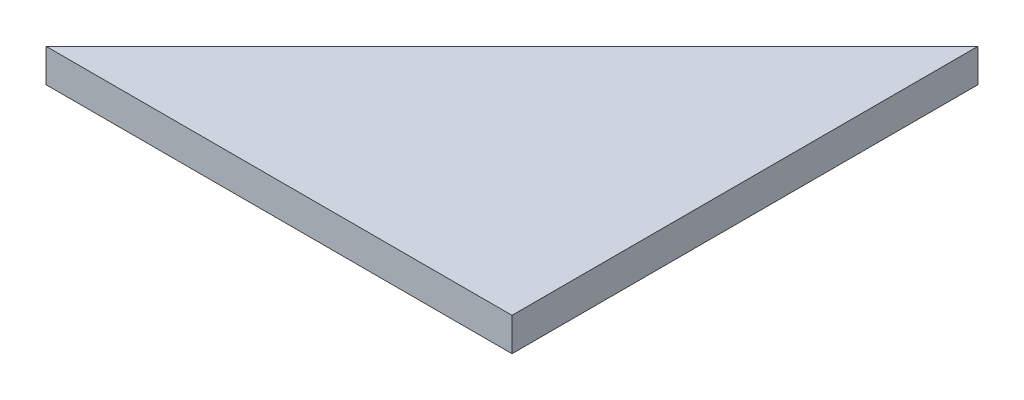
ISO-10303-21;
HEADER;
FILE_DESCRIPTION(('STEP AP214'),'2;1');
FILE_NAME('part.step','',(''),(''),'','','');
FILE_SCHEMA(('AUTOMOTIVE_DESIGN { 1 0 10303 214 1 1 1 1 }'));
ENDSEC;
DATA;
#1=APPLICATION_CONTEXT('core data for automotive mechanical design processes');
#2=APPLICATION_PROTOCOL_DEFINITION('international standard','automotive_design',2000,#1);
#3=PRODUCT_CONTEXT('',#1,'mechanical');
#4=PRODUCT('Part','Part','',(#3));
#5=PRODUCT_RELATED_PRODUCT_CATEGORY('part','',(#4));
#6=PRODUCT_DEFINITION_FORMATION('','',#4);
#7=PRODUCT_DEFINITION_CONTEXT('part definition',#1,'design');
#8=PRODUCT_DEFINITION('design','',#6,#7);
#9=PRODUCT_DEFINITION_SHAPE('','',#8);
#10=(LENGTH_UNIT() NAMED_UNIT(*) SI_UNIT(.MILLI.,.METRE.));
#11=(NAMED_UNIT(*) PLANE_ANGLE_UNIT() SI_UNIT($,.RADIAN.));
#12=(NAMED_UNIT(*) SI_UNIT($,.STERADIAN.) SOLID_ANGLE_UNIT());
#13=UNCERTAINTY_MEASURE_WITH_UNIT(LENGTH_MEASURE(1.E-05),#10,'distance_accuracy_value','');
#14=(GEOMETRIC_REPRESENTATION_CONTEXT(3) GLOBAL_UNCERTAINTY_ASSIGNED_CONTEXT((#13)) GLOBAL_UNIT_ASSIGNED_CONTEXT((#10,
#11,#12)) REPRESENTATION_CONTEXT('',''));
#15=CARTESIAN_POINT('',(0.,0.,0.));
#16=DIRECTION('',(0.,0.,1.));
#17=DIRECTION('',(1.,0.,0.));
#18=AXIS2_PLACEMENT_3D('',#15,#16,#17);
#19=CARTESIAN_POINT('',(21.,3.,-30.2851239669421));
#20=DIRECTION('',(-1.,0.,0.));
#21=DIRECTION('',(0.,0.,1.));
#22=AXIS2_PLACEMENT_3D('',#19,#20,#21);
#23=PLANE('',#22);
#24=DIRECTION('',(0.,0.,-1.));
#25=VECTOR('',#24,1.);
#26=CARTESIAN_POINT('',(21.,0.,-30.2851239669421));
#27=LINE('',#26,#25);
#28=CARTESIAN_POINT('',(21.,0.,11.7148760330579));
#29=VERTEX_POINT('',#28);
#30=CARTESIAN_POINT('',(21.,0.,-30.2851239669421));
#31=VERTEX_POINT('',#30);
#32=EDGE_CURVE('E80',#29,#31,#27,.T.);
#33=ORIENTED_EDGE('',*,*,#32,.T.);
#34=DIRECTION('',(0.,-1.,0.));
#35=VECTOR('',#34,1.);
#36=CARTESIAN_POINT('',(21.,3.,-30.2851239669421));
#37=LINE('',#36,#35);
#38=CARTESIAN_POINT('',(21.,3.,-30.2851239669421));
#39=VERTEX_POINT('',#38);
#40=EDGE_CURVE('E11',#39,#31,#37,.T.);
#41=ORIENTED_EDGE('',*,*,#40,.F.);
#42=DIRECTION('',(0.,0.,-1.));
#43=VECTOR('',#42,1.);
#44=CARTESIAN_POINT('',(21.,3.,-30.2851239669421));
#45=LINE('',#44,#43);
#46=CARTESIAN_POINT('',(21.,3.,11.7148760330579));
#47=VERTEX_POINT('',#46);
#48=EDGE_CURVE('E73',#47,#39,#45,.T.);
#49=ORIENTED_EDGE('',*,*,#48,.F.);
#50=DIRECTION('',(0.,-1.,0.));
#51=VECTOR('',#50,1.);
#52=CARTESIAN_POINT('',(21.,3.,11.7148760330579));
#53=LINE('',#52,#51);
#54=EDGE_CURVE('E81',#47,#29,#53,.T.);
#55=ORIENTED_EDGE('',*,*,#54,.T.);
#56=EDGE_LOOP('',(#33,#41,#49,#55));
#57=FACE_BOUND('',#56,.T.);
#58=ADVANCED_FACE('F33',(#57),#23,.F.);
#59=CARTESIAN_POINT('',(-21.,3.,11.7148760330579));
#60=DIRECTION('',(0.707106781186547,0.,0.707106781186547));
#61=DIRECTION('',(0.707106781186548,0.,-0.707106781186548));
#62=AXIS2_PLACEMENT_3D('',#59,#60,#61);
#63=PLANE('',#62);
#64=DIRECTION('',(-0.707106781186548,0.,0.707106781186548));
#65=VECTOR('',#64,1.);
#66=CARTESIAN_POINT('',(-21.,0.,11.7148760330579));
#67=LINE('',#66,#65);
#68=CARTESIAN_POINT('',(-21.,0.,11.7148760330579));
#69=VERTEX_POINT('',#68);
#70=EDGE_CURVE('E61',#31,#69,#67,.T.);
#71=ORIENTED_EDGE('',*,*,#70,.T.);
#72=DIRECTION('',(0.,-1.,0.));
#73=VECTOR('',#72,1.);
#74=CARTESIAN_POINT('',(-21.,3.,11.7148760330579));
#75=LINE('',#74,#73);
#76=CARTESIAN_POINT('',(-21.,3.,11.7148760330579));
#77=VERTEX_POINT('',#76);
#78=EDGE_CURVE('E41',#77,#69,#75,.T.);
#79=ORIENTED_EDGE('',*,*,#78,.F.);
#80=DIRECTION('',(-0.707106781186548,0.,0.707106781186548));
#81=VECTOR('',#80,1.);
#82=CARTESIAN_POINT('',(-21.,3.,11.7148760330579));
#83=LINE('',#82,#81);
#84=EDGE_CURVE('E69',#39,#77,#83,.T.);
#85=ORIENTED_EDGE('',*,*,#84,.F.);
#86=ORIENTED_EDGE('',*,*,#40,.T.);
#87=EDGE_LOOP('',(#71,#79,#85,#86));
#88=FACE_BOUND('',#87,.T.);
#89=ADVANCED_FACE('F70',(#88),#63,.F.);
#90=CARTESIAN_POINT('',(-21.,3.,11.7148760330579));
#91=DIRECTION('',(0.,0.,-1.));
#92=DIRECTION('',(-1.,0.,0.));
#93=AXIS2_PLACEMENT_3D('',#90,#91,#92);
#94=PLANE('',#93);
#95=DIRECTION('',(1.,0.,0.));
#96=VECTOR('',#95,1.);
#97=CARTESIAN_POINT('',(-21.,0.,11.7148760330579));
#98=LINE('',#97,#96);
#99=EDGE_CURVE('E66',#69,#29,#98,.T.);
#100=ORIENTED_EDGE('',*,*,#99,.T.);
#101=ORIENTED_EDGE('',*,*,#54,.F.);
#102=DIRECTION('',(1.,0.,0.));
#103=VECTOR('',#102,1.);
#104=CARTESIAN_POINT('',(-21.,3.,11.7148760330579));
#105=LINE('',#104,#103);
#106=EDGE_CURVE('E49',#77,#47,#105,.T.);
#107=ORIENTED_EDGE('',*,*,#106,.F.);
#108=ORIENTED_EDGE('',*,*,#78,.T.);
#109=EDGE_LOOP('',(#100,#101,#107,#108));
#110=FACE_BOUND('',#109,.T.);
#111=ADVANCED_FACE('F88',(#110),#94,.F.);
#112=CARTESIAN_POINT('',(0.,3.,0.));
#113=DIRECTION('',(0.,1.,0.));
#114=DIRECTION('',(0.,0.,1.));
#115=AXIS2_PLACEMENT_3D('',#112,#113,#114);
#116=PLANE('',#115);
#117=ORIENTED_EDGE('',*,*,#48,.T.);
#118=ORIENTED_EDGE('',*,*,#84,.T.);
#119=ORIENTED_EDGE('',*,*,#106,.T.);
#120=EDGE_LOOP('',(#117,#118,#119));
#121=FACE_BOUND('',#120,.T.);
#122=ADVANCED_FACE('F76',(#121),#116,.T.);
#123=CARTESIAN_POINT('',(0.,0.,0.));
#124=DIRECTION('',(0.,1.,0.));
#125=DIRECTION('',(0.,0.,1.));
#126=AXIS2_PLACEMENT_3D('',#123,#124,#125);
#127=PLANE('',#126);
#128=ORIENTED_EDGE('',*,*,#32,.F.);
#129=ORIENTED_EDGE('',*,*,#99,.F.);
#130=ORIENTED_EDGE('',*,*,#70,.F.);
#131=EDGE_LOOP('',(#128,#129,#130));
#132=FACE_BOUND('',#131,.T.);
#133=ADVANCED_FACE('F89',(#132),#127,.F.);
#134=CLOSED_SHELL('',(#58,#89,#111,#122,#133));
#135=MANIFOLD_SOLID_BREP('B2',#134);
#136=ADVANCED_BREP_SHAPE_REPRESENTATION('',(#18,#135),#14);
#137=SHAPE_DEFINITION_REPRESENTATION(#9,#136);
ENDSEC;
END-ISO-10303-21;
